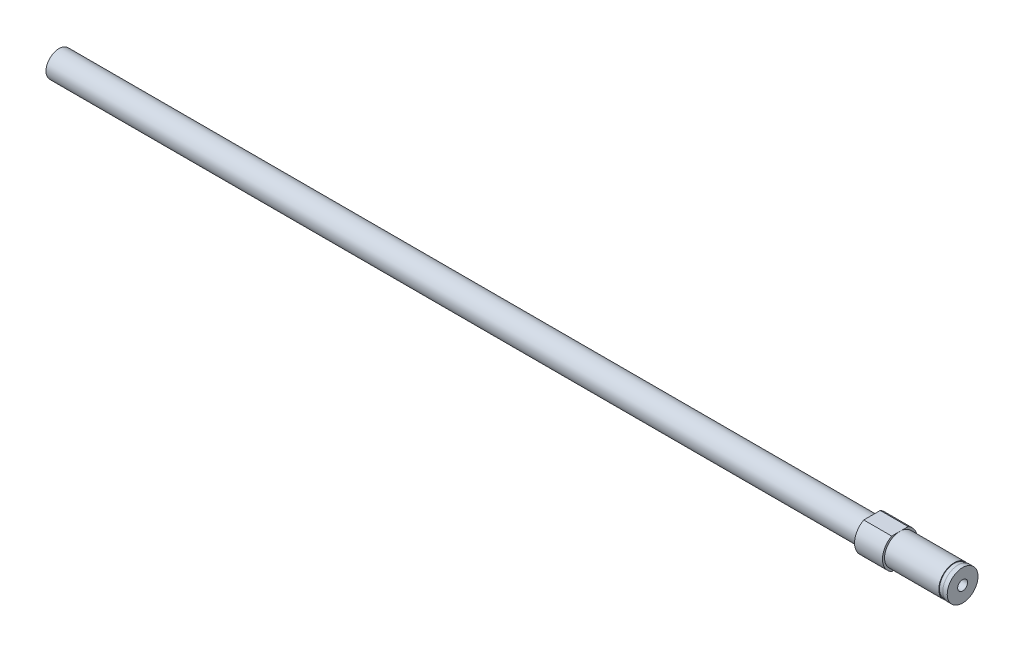
ISO-10303-21;
HEADER;
FILE_DESCRIPTION(('STEP AP214'),'2;1');
FILE_NAME('part.step','',(''),(''),'','','');
FILE_SCHEMA(('AUTOMOTIVE_DESIGN { 1 0 10303 214 1 1 1 1 }'));
ENDSEC;
DATA;
#1=APPLICATION_CONTEXT('core data for automotive mechanical design processes');
#2=APPLICATION_PROTOCOL_DEFINITION('international standard','automotive_design',2000,#1);
#3=PRODUCT_CONTEXT('',#1,'mechanical');
#4=PRODUCT('Part','Part','',(#3));
#5=PRODUCT_RELATED_PRODUCT_CATEGORY('part','',(#4));
#6=PRODUCT_DEFINITION_FORMATION('','',#4);
#7=PRODUCT_DEFINITION_CONTEXT('part definition',#1,'design');
#8=PRODUCT_DEFINITION('design','',#6,#7);
#9=PRODUCT_DEFINITION_SHAPE('','',#8);
#10=(LENGTH_UNIT() NAMED_UNIT(*) SI_UNIT(.MILLI.,.METRE.));
#11=(NAMED_UNIT(*) PLANE_ANGLE_UNIT() SI_UNIT($,.RADIAN.));
#12=(NAMED_UNIT(*) SI_UNIT($,.STERADIAN.) SOLID_ANGLE_UNIT());
#13=UNCERTAINTY_MEASURE_WITH_UNIT(LENGTH_MEASURE(1.E-05),#10,'distance_accuracy_value','');
#14=(GEOMETRIC_REPRESENTATION_CONTEXT(3) GLOBAL_UNCERTAINTY_ASSIGNED_CONTEXT((#13)) GLOBAL_UNIT_ASSIGNED_CONTEXT((#10,
#11,#12)) REPRESENTATION_CONTEXT('',''));
#15=CARTESIAN_POINT('',(0.,0.,0.));
#16=DIRECTION('',(0.,0.,1.));
#17=DIRECTION('',(1.,0.,0.));
#18=AXIS2_PLACEMENT_3D('',#15,#16,#17);
#19=CARTESIAN_POINT('',(-20.6104,2.94999999999998,0.));
#20=DIRECTION('',(-1.,0.,0.));
#21=DIRECTION('',(0.,-1.,0.));
#22=AXIS2_PLACEMENT_3D('',#19,#20,#21);
#23=PLANE('',#22);
#24=CARTESIAN_POINT('',(-20.6104,0.,0.));
#25=DIRECTION('',(1.,0.,0.));
#26=DIRECTION('',(0.,1.,0.));
#27=AXIS2_PLACEMENT_3D('',#24,#25,#26);
#28=CIRCLE('',#27,2.94999999999999);
#29=CARTESIAN_POINT('',(-20.6104,2.94999999999998,0.));
#30=VERTEX_POINT('',#29);
#31=EDGE_CURVE('E53',#30,#30,#28,.T.);
#32=ORIENTED_EDGE('',*,*,#31,.T.);
#33=EDGE_LOOP('',(#32));
#34=FACE_BOUND('',#33,.T.);
#35=CARTESIAN_POINT('',(-20.6104,0.,0.));
#36=DIRECTION('',(1.,0.,0.));
#37=DIRECTION('',(0.,1.,0.));
#38=AXIS2_PLACEMENT_3D('',#35,#36,#37);
#39=CIRCLE('',#38,3.96875);
#40=CARTESIAN_POINT('',(-20.6104,3.5,1.87108967249034));
#41=VERTEX_POINT('',#40);
#42=CARTESIAN_POINT('',(-20.6104,-3.5,1.87108967249034));
#43=VERTEX_POINT('',#42);
#44=EDGE_CURVE('E151',#41,#43,#39,.T.);
#45=ORIENTED_EDGE('',*,*,#44,.F.);
#46=DIRECTION('',(0.,0.,-1.));
#47=VECTOR('',#46,1.);
#48=CARTESIAN_POINT('',(-20.6104,3.5,0.));
#49=LINE('',#48,#47);
#50=CARTESIAN_POINT('',(-20.6104,3.5,-1.87108967249034));
#51=VERTEX_POINT('',#50);
#52=EDGE_CURVE('E122',#41,#51,#49,.T.);
#53=ORIENTED_EDGE('',*,*,#52,.T.);
#54=CARTESIAN_POINT('',(-20.6104,-3.5,-1.87108967249034));
#55=VERTEX_POINT('',#54);
#56=EDGE_CURVE('E150',#55,#51,#39,.T.);
#57=ORIENTED_EDGE('',*,*,#56,.F.);
#58=DIRECTION('',(0.,0.,1.));
#59=VECTOR('',#58,1.);
#60=CARTESIAN_POINT('',(-20.6104,-3.5,0.));
#61=LINE('',#60,#59);
#62=EDGE_CURVE('E112',#55,#43,#61,.T.);
#63=ORIENTED_EDGE('',*,*,#62,.T.);
#64=EDGE_LOOP('',(#45,#53,#57,#63));
#65=FACE_BOUND('',#64,.T.);
#66=ADVANCED_FACE('F45',(#34,#65),#23,.T.);
#67=CARTESIAN_POINT('',(0.,0.,0.));
#68=DIRECTION('',(1.,0.,0.));
#69=DIRECTION('',(0.,1.,0.));
#70=AXIS2_PLACEMENT_3D('',#67,#68,#69);
#71=CYLINDRICAL_SURFACE('',#70,3.96875);
#72=ORIENTED_EDGE('',*,*,#44,.T.);
#73=DIRECTION('',(1.,0.,0.));
#74=VECTOR('',#73,1.);
#75=CARTESIAN_POINT('',(0.,-3.5,1.87108967249034));
#76=LINE('',#75,#74);
#77=CARTESIAN_POINT('',(-14.2604,-3.5,1.87108967249034));
#78=VERTEX_POINT('',#77);
#79=EDGE_CURVE('E115',#43,#78,#76,.T.);
#80=ORIENTED_EDGE('',*,*,#79,.T.);
#81=CARTESIAN_POINT('',(-14.2604,0.,0.));
#82=DIRECTION('',(1.,0.,0.));
#83=DIRECTION('',(0.,1.,0.));
#84=AXIS2_PLACEMENT_3D('',#81,#82,#83);
#85=CIRCLE('',#84,3.96875);
#86=CARTESIAN_POINT('',(-14.2604,3.5,1.87108967249034));
#87=VERTEX_POINT('',#86);
#88=EDGE_CURVE('E148',#87,#78,#85,.T.);
#89=ORIENTED_EDGE('',*,*,#88,.F.);
#90=DIRECTION('',(1.,0.,0.));
#91=VECTOR('',#90,1.);
#92=CARTESIAN_POINT('',(0.,3.5,1.87108967249034));
#93=LINE('',#92,#91);
#94=EDGE_CURVE('E68',#87,#41,#93,.F.);
#95=ORIENTED_EDGE('',*,*,#94,.T.);
#96=EDGE_LOOP('',(#72,#80,#89,#95));
#97=FACE_BOUND('',#96,.T.);
#98=ADVANCED_FACE('F173',(#97),#71,.T.);
#99=ORIENTED_EDGE('',*,*,#56,.T.);
#100=DIRECTION('',(1.,0.,0.));
#101=VECTOR('',#100,1.);
#102=CARTESIAN_POINT('',(0.,3.5,-1.87108967249034));
#103=LINE('',#102,#101);
#104=CARTESIAN_POINT('',(-14.2604,3.5,-1.87108967249034));
#105=VERTEX_POINT('',#104);
#106=EDGE_CURVE('E125',#51,#105,#103,.T.);
#107=ORIENTED_EDGE('',*,*,#106,.T.);
#108=CARTESIAN_POINT('',(-14.2604,-3.5,-1.87108967249034));
#109=VERTEX_POINT('',#108);
#110=EDGE_CURVE('E147',#109,#105,#85,.T.);
#111=ORIENTED_EDGE('',*,*,#110,.F.);
#112=DIRECTION('',(1.,0.,0.));
#113=VECTOR('',#112,1.);
#114=CARTESIAN_POINT('',(0.,-3.5,-1.87108967249034));
#115=LINE('',#114,#113);
#116=EDGE_CURVE('E60',#109,#55,#115,.F.);
#117=ORIENTED_EDGE('',*,*,#116,.T.);
#118=EDGE_LOOP('',(#99,#107,#111,#117));
#119=FACE_BOUND('',#118,.T.);
#120=ADVANCED_FACE('F177',(#119),#71,.T.);
#121=CARTESIAN_POINT('',(-14.2604,3.96875,0.));
#122=DIRECTION('',(1.,0.,0.));
#123=DIRECTION('',(0.,1.,0.));
#124=AXIS2_PLACEMENT_3D('',#121,#122,#123);
#125=PLANE('',#124);
#126=ORIENTED_EDGE('',*,*,#110,.T.);
#127=DIRECTION('',(0.,0.,1.));
#128=VECTOR('',#127,1.);
#129=CARTESIAN_POINT('',(-14.2604,3.5,0.));
#130=LINE('',#129,#128);
#131=CARTESIAN_POINT('',(-14.2604,3.5,0.));
#132=VERTEX_POINT('',#131);
#133=EDGE_CURVE('E120',#105,#132,#130,.T.);
#134=ORIENTED_EDGE('',*,*,#133,.T.);
#135=CARTESIAN_POINT('',(-14.2604,0.,0.));
#136=DIRECTION('',(1.,0.,0.));
#137=DIRECTION('',(0.,1.,0.));
#138=AXIS2_PLACEMENT_3D('',#135,#136,#137);
#139=CIRCLE('',#138,3.5);
#140=CARTESIAN_POINT('',(-14.2604,-3.5,0.));
#141=VERTEX_POINT('',#140);
#142=EDGE_CURVE('E143',#141,#132,#139,.T.);
#143=ORIENTED_EDGE('',*,*,#142,.F.);
#144=DIRECTION('',(0.,0.,-1.));
#145=VECTOR('',#144,1.);
#146=CARTESIAN_POINT('',(-14.2604,-3.5,0.));
#147=LINE('',#146,#145);
#148=EDGE_CURVE('E103',#141,#109,#147,.T.);
#149=ORIENTED_EDGE('',*,*,#148,.T.);
#150=EDGE_LOOP('',(#126,#134,#143,#149));
#151=FACE_BOUND('',#150,.T.);
#152=ADVANCED_FACE('F181',(#151),#125,.T.);
#153=EDGE_CURVE('E144',#132,#141,#139,.T.);
#154=ORIENTED_EDGE('',*,*,#153,.F.);
#155=EDGE_CURVE('E118',#132,#87,#130,.T.);
#156=ORIENTED_EDGE('',*,*,#155,.T.);
#157=ORIENTED_EDGE('',*,*,#88,.T.);
#158=EDGE_CURVE('E107',#78,#141,#147,.T.);
#159=ORIENTED_EDGE('',*,*,#158,.T.);
#160=EDGE_LOOP('',(#154,#156,#157,#159));
#161=FACE_BOUND('',#160,.T.);
#162=ADVANCED_FACE('F183',(#161),#125,.T.);
#163=CARTESIAN_POINT('',(0.,3.5,0.));
#164=DIRECTION('',(1.,0.,0.));
#165=DIRECTION('',(0.,1.,0.));
#166=AXIS2_PLACEMENT_3D('',#163,#164,#165);
#167=PLANE('',#166);
#168=CARTESIAN_POINT('',(0.,0.,0.));
#169=DIRECTION('',(1.,0.,0.));
#170=DIRECTION('',(0.,0.,-1.));
#171=AXIS2_PLACEMENT_3D('',#168,#169,#170);
#172=CIRCLE('',#171,1.13029999999999);
#173=CARTESIAN_POINT('',(0.,0.,-1.13029999999999));
#174=VERTEX_POINT('',#173);
#175=EDGE_CURVE('E104',#174,#174,#172,.T.);
#176=ORIENTED_EDGE('',*,*,#175,.F.);
#177=EDGE_LOOP('',(#176));
#178=FACE_BOUND('',#177,.T.);
#179=CARTESIAN_POINT('',(0.,0.,0.));
#180=DIRECTION('',(1.,0.,0.));
#181=DIRECTION('',(0.,1.,0.));
#182=AXIS2_PLACEMENT_3D('',#179,#180,#181);
#183=CIRCLE('',#182,3.5);
#184=CARTESIAN_POINT('',(0.,3.5,0.));
#185=VERTEX_POINT('',#184);
#186=EDGE_CURVE('E128',#185,#185,#183,.T.);
#187=ORIENTED_EDGE('',*,*,#186,.T.);
#188=EDGE_LOOP('',(#187));
#189=FACE_BOUND('',#188,.T.);
#190=ADVANCED_FACE('F47',(#178,#189),#167,.T.);
#191=CARTESIAN_POINT('',(-205.5224,0.,0.));
#192=DIRECTION('',(-1.,0.,0.));
#193=DIRECTION('',(0.,-1.,0.));
#194=AXIS2_PLACEMENT_3D('',#191,#192,#193);
#195=PLANE('',#194);
#196=CARTESIAN_POINT('',(-205.5224,0.,0.));
#197=DIRECTION('',(1.,0.,0.));
#198=DIRECTION('',(0.,1.,0.));
#199=AXIS2_PLACEMENT_3D('',#196,#197,#198);
#200=CIRCLE('',#199,2.95000000000001);
#201=CARTESIAN_POINT('',(-205.5224,2.94999999999998,0.));
#202=VERTEX_POINT('',#201);
#203=EDGE_CURVE('E12',#202,#202,#200,.T.);
#204=ORIENTED_EDGE('',*,*,#203,.F.);
#205=EDGE_LOOP('',(#204));
#206=FACE_BOUND('',#205,.T.);
#207=ADVANCED_FACE('F160',(#206),#195,.T.);
#208=CARTESIAN_POINT('',(0.,0.,0.));
#209=DIRECTION('',(1.,0.,0.));
#210=DIRECTION('',(0.,1.,0.));
#211=AXIS2_PLACEMENT_3D('',#208,#209,#210);
#212=CYLINDRICAL_SURFACE('',#211,2.95);
#213=ORIENTED_EDGE('',*,*,#203,.T.);
#214=EDGE_LOOP('',(#213));
#215=FACE_BOUND('',#214,.T.);
#216=ORIENTED_EDGE('',*,*,#31,.F.);
#217=EDGE_LOOP('',(#216));
#218=FACE_BOUND('',#217,.T.);
#219=ADVANCED_FACE('F157',(#215,#218),#212,.T.);
#220=CARTESIAN_POINT('',(0.,0.,0.));
#221=DIRECTION('',(1.,0.,0.));
#222=DIRECTION('',(0.,1.,0.));
#223=AXIS2_PLACEMENT_3D('',#220,#221,#222);
#224=CYLINDRICAL_SURFACE('',#223,3.5);
#225=ORIENTED_EDGE('',*,*,#142,.T.);
#226=ORIENTED_EDGE('',*,*,#153,.T.);
#227=EDGE_LOOP('',(#225,#226));
#228=FACE_BOUND('',#227,.T.);
#229=CARTESIAN_POINT('',(-1.916,0.,0.));
#230=DIRECTION('',(1.,0.,0.));
#231=DIRECTION('',(0.,1.,0.));
#232=AXIS2_PLACEMENT_3D('',#229,#230,#231);
#233=CIRCLE('',#232,3.5);
#234=CARTESIAN_POINT('',(-1.916,3.5,0.));
#235=VERTEX_POINT('',#234);
#236=EDGE_CURVE('E140',#235,#235,#233,.T.);
#237=ORIENTED_EDGE('',*,*,#236,.F.);
#238=EDGE_LOOP('',(#237));
#239=FACE_BOUND('',#238,.T.);
#240=ADVANCED_FACE('F159',(#228,#239),#224,.T.);
#241=CARTESIAN_POINT('',(-1.916,3.5,0.));
#242=DIRECTION('',(1.,0.,0.));
#243=DIRECTION('',(0.,1.,0.));
#244=AXIS2_PLACEMENT_3D('',#241,#242,#243);
#245=PLANE('',#244);
#246=ORIENTED_EDGE('',*,*,#236,.T.);
#247=EDGE_LOOP('',(#246));
#248=FACE_BOUND('',#247,.T.);
#249=CARTESIAN_POINT('',(-1.916,0.,0.));
#250=DIRECTION('',(1.,0.,0.));
#251=DIRECTION('',(0.,1.,0.));
#252=AXIS2_PLACEMENT_3D('',#249,#250,#251);
#253=CIRCLE('',#252,3.35);
#254=CARTESIAN_POINT('',(-1.916,3.35,0.));
#255=VERTEX_POINT('',#254);
#256=EDGE_CURVE('E137',#255,#255,#253,.T.);
#257=ORIENTED_EDGE('',*,*,#256,.F.);
#258=EDGE_LOOP('',(#257));
#259=FACE_BOUND('',#258,.T.);
#260=ADVANCED_FACE('F167',(#248,#259),#245,.T.);
#261=CARTESIAN_POINT('',(0.,0.,0.));
#262=DIRECTION('',(1.,0.,0.));
#263=DIRECTION('',(0.,1.,0.));
#264=AXIS2_PLACEMENT_3D('',#261,#262,#263);
#265=CYLINDRICAL_SURFACE('',#264,3.35);
#266=ORIENTED_EDGE('',*,*,#256,.T.);
#267=EDGE_LOOP('',(#266));
#268=FACE_BOUND('',#267,.T.);
#269=CARTESIAN_POINT('',(-1.016,0.,0.));
#270=DIRECTION('',(1.,0.,0.));
#271=DIRECTION('',(0.,1.,0.));
#272=AXIS2_PLACEMENT_3D('',#269,#270,#271);
#273=CIRCLE('',#272,3.35);
#274=CARTESIAN_POINT('',(-1.016,3.35,0.));
#275=VERTEX_POINT('',#274);
#276=EDGE_CURVE('E134',#275,#275,#273,.T.);
#277=ORIENTED_EDGE('',*,*,#276,.F.);
#278=EDGE_LOOP('',(#277));
#279=FACE_BOUND('',#278,.T.);
#280=ADVANCED_FACE('F188',(#268,#279),#265,.T.);
#281=CARTESIAN_POINT('',(-1.016,3.35,0.));
#282=DIRECTION('',(-1.,0.,0.));
#283=DIRECTION('',(0.,-1.,0.));
#284=AXIS2_PLACEMENT_3D('',#281,#282,#283);
#285=PLANE('',#284);
#286=ORIENTED_EDGE('',*,*,#276,.T.);
#287=EDGE_LOOP('',(#286));
#288=FACE_BOUND('',#287,.T.);
#289=CARTESIAN_POINT('',(-1.016,0.,0.));
#290=DIRECTION('',(1.,0.,0.));
#291=DIRECTION('',(0.,1.,0.));
#292=AXIS2_PLACEMENT_3D('',#289,#290,#291);
#293=CIRCLE('',#292,3.5);
#294=CARTESIAN_POINT('',(-1.016,3.5,0.));
#295=VERTEX_POINT('',#294);
#296=EDGE_CURVE('E131',#295,#295,#293,.T.);
#297=ORIENTED_EDGE('',*,*,#296,.F.);
#298=EDGE_LOOP('',(#297));
#299=FACE_BOUND('',#298,.T.);
#300=ADVANCED_FACE('F192',(#288,#299),#285,.T.);
#301=CARTESIAN_POINT('',(0.,0.,0.));
#302=DIRECTION('',(1.,0.,0.));
#303=DIRECTION('',(0.,1.,0.));
#304=AXIS2_PLACEMENT_3D('',#301,#302,#303);
#305=CYLINDRICAL_SURFACE('',#304,3.5);
#306=ORIENTED_EDGE('',*,*,#296,.T.);
#307=EDGE_LOOP('',(#306));
#308=FACE_BOUND('',#307,.T.);
#309=ORIENTED_EDGE('',*,*,#186,.F.);
#310=EDGE_LOOP('',(#309));
#311=FACE_BOUND('',#310,.T.);
#312=ADVANCED_FACE('F196',(#308,#311),#305,.T.);
#313=CARTESIAN_POINT('',(-205.5224,-3.50000000000003,3.96875));
#314=DIRECTION('',(0.,-1.,0.));
#315=DIRECTION('',(1.,0.,0.));
#316=AXIS2_PLACEMENT_3D('',#313,#314,#315);
#317=PLANE('',#316);
#318=ORIENTED_EDGE('',*,*,#79,.F.);
#319=ORIENTED_EDGE('',*,*,#62,.F.);
#320=ORIENTED_EDGE('',*,*,#116,.F.);
#321=ORIENTED_EDGE('',*,*,#148,.F.);
#322=ORIENTED_EDGE('',*,*,#158,.F.);
#323=EDGE_LOOP('',(#318,#319,#320,#321,#322));
#324=FACE_BOUND('',#323,.T.);
#325=ADVANCED_FACE('F200',(#324),#317,.T.);
#326=CARTESIAN_POINT('',(-205.5224,3.49999999999998,3.96875));
#327=DIRECTION('',(0.,1.,0.));
#328=DIRECTION('',(-1.,0.,0.));
#329=AXIS2_PLACEMENT_3D('',#326,#327,#328);
#330=PLANE('',#329);
#331=ORIENTED_EDGE('',*,*,#106,.F.);
#332=ORIENTED_EDGE('',*,*,#52,.F.);
#333=ORIENTED_EDGE('',*,*,#94,.F.);
#334=ORIENTED_EDGE('',*,*,#155,.F.);
#335=ORIENTED_EDGE('',*,*,#133,.F.);
#336=EDGE_LOOP('',(#331,#332,#333,#334,#335));
#337=FACE_BOUND('',#336,.T.);
#338=ADVANCED_FACE('F97',(#337),#330,.T.);
#339=CARTESIAN_POINT('',(-7.62,0.,0.));
#340=DIRECTION('',(1.,0.,0.));
#341=DIRECTION('',(0.,0.,-1.));
#342=AXIS2_PLACEMENT_3D('',#339,#340,#341);
#343=CONICAL_SURFACE('',#342,1.13029999999999,1.02974425867665);
#344=CARTESIAN_POINT('',(-8.29915275768685,0.,0.));
#345=VERTEX_POINT('',#344);
#346=VERTEX_LOOP('',#345);
#347=FACE_BOUND('',#346,.T.);
#348=CARTESIAN_POINT('',(-7.62,0.,0.));
#349=DIRECTION('',(1.,0.,0.));
#350=DIRECTION('',(0.,0.,-1.));
#351=AXIS2_PLACEMENT_3D('',#348,#349,#350);
#352=CIRCLE('',#351,1.13029999999999);
#353=CARTESIAN_POINT('',(-7.62,0.,-1.13029999999999));
#354=VERTEX_POINT('',#353);
#355=EDGE_CURVE('E101',#354,#354,#352,.T.);
#356=ORIENTED_EDGE('',*,*,#355,.T.);
#357=EDGE_LOOP('',(#356));
#358=FACE_BOUND('',#357,.T.);
#359=ADVANCED_FACE('F93',(#347,#358),#343,.F.);
#360=CARTESIAN_POINT('',(0.,0.,0.));
#361=DIRECTION('',(1.,0.,0.));
#362=DIRECTION('',(0.,0.,-1.));
#363=AXIS2_PLACEMENT_3D('',#360,#361,#362);
#364=CYLINDRICAL_SURFACE('',#363,1.13029999999999);
#365=ORIENTED_EDGE('',*,*,#355,.F.);
#366=EDGE_LOOP('',(#365));
#367=FACE_BOUND('',#366,.T.);
#368=ORIENTED_EDGE('',*,*,#175,.T.);
#369=EDGE_LOOP('',(#368));
#370=FACE_BOUND('',#369,.T.);
#371=ADVANCED_FACE('F96',(#367,#370),#364,.F.);
#372=CLOSED_SHELL('',(#66,#98,#120,#152,#162,#190,#207,#219,#240,#260,#280,#300,#312,#325,#338,
#359,#371));
#373=MANIFOLD_SOLID_BREP('B2',#372);
#374=ADVANCED_BREP_SHAPE_REPRESENTATION('',(#18,#373),#14);
#375=SHAPE_DEFINITION_REPRESENTATION(#9,#374);
ENDSEC;
END-ISO-10303-21;
